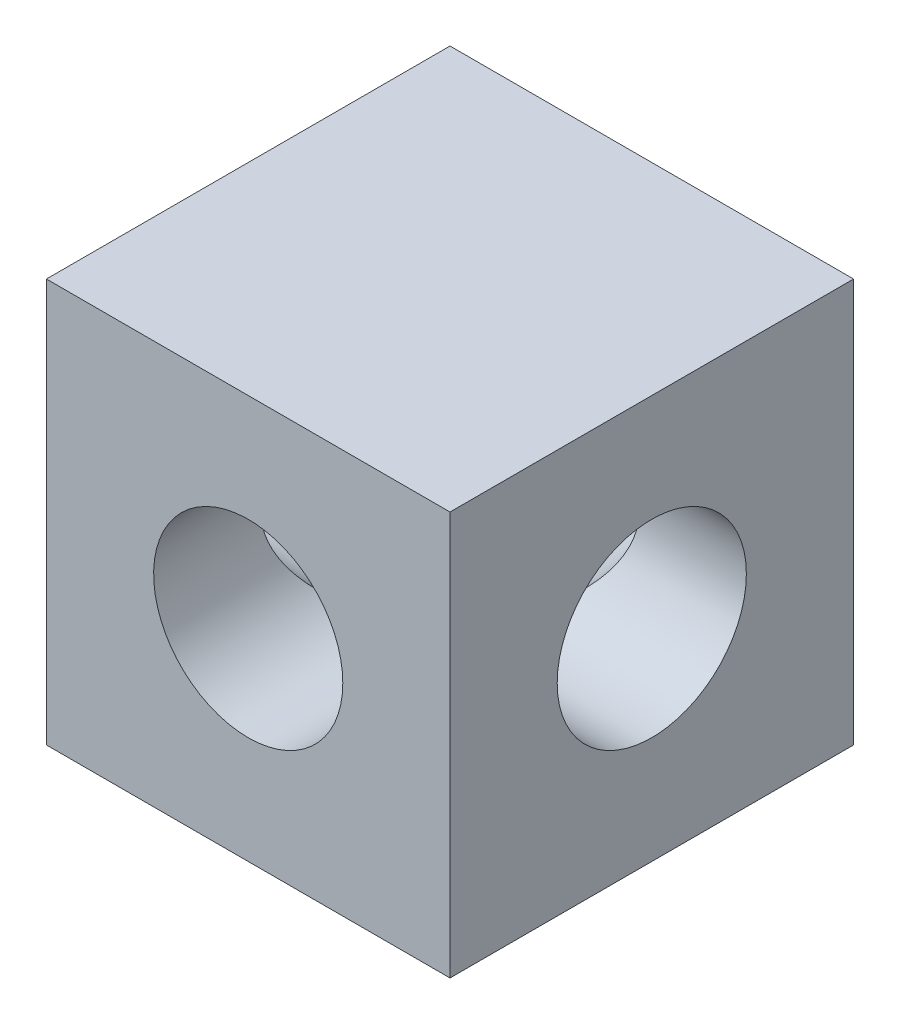
ISO-10303-21;
HEADER;
FILE_DESCRIPTION(('STEP AP214'),'2;1');
FILE_NAME('part.step','',(''),(''),'','','');
FILE_SCHEMA(('AUTOMOTIVE_DESIGN { 1 0 10303 214 1 1 1 1 }'));
ENDSEC;
DATA;
#1=APPLICATION_CONTEXT('core data for automotive mechanical design processes');
#2=APPLICATION_PROTOCOL_DEFINITION('international standard','automotive_design',2000,#1);
#3=PRODUCT_CONTEXT('',#1,'mechanical');
#4=PRODUCT('Part','Part','',(#3));
#5=PRODUCT_RELATED_PRODUCT_CATEGORY('part','',(#4));
#6=PRODUCT_DEFINITION_FORMATION('','',#4);
#7=PRODUCT_DEFINITION_CONTEXT('part definition',#1,'design');
#8=PRODUCT_DEFINITION('design','',#6,#7);
#9=PRODUCT_DEFINITION_SHAPE('','',#8);
#10=(LENGTH_UNIT() NAMED_UNIT(*) SI_UNIT(.MILLI.,.METRE.));
#11=(NAMED_UNIT(*) PLANE_ANGLE_UNIT() SI_UNIT($,.RADIAN.));
#12=(NAMED_UNIT(*) SI_UNIT($,.STERADIAN.) SOLID_ANGLE_UNIT());
#13=UNCERTAINTY_MEASURE_WITH_UNIT(LENGTH_MEASURE(1.E-05),#10,'distance_accuracy_value','');
#14=(GEOMETRIC_REPRESENTATION_CONTEXT(3) GLOBAL_UNCERTAINTY_ASSIGNED_CONTEXT((#13)) GLOBAL_UNIT_ASSIGNED_CONTEXT((#10,
#11,#12)) REPRESENTATION_CONTEXT('',''));
#15=CARTESIAN_POINT('',(0.,0.,0.));
#16=DIRECTION('',(0.,0.,1.));
#17=DIRECTION('',(1.,0.,0.));
#18=AXIS2_PLACEMENT_3D('',#15,#16,#17);
#19=CARTESIAN_POINT('',(0.,0.,10.16));
#20=DIRECTION('',(0.,0.,-1.));
#21=DIRECTION('',(-1.,0.,0.));
#22=AXIS2_PLACEMENT_3D('',#19,#20,#21);
#23=CYLINDRICAL_SURFACE('',#22,4.7625);
#24=CARTESIAN_POINT('',(0.,0.,0.));
#25=DIRECTION('',(0.707106781186547,0.,-0.707106781186547));
#26=DIRECTION('',(-0.707106781186547,0.,-0.707106781186547));
#27=AXIS2_PLACEMENT_3D('',#24,#25,#26);
#28=ELLIPSE('',#27,6.73519209080187,4.7625);
#29=CARTESIAN_POINT('',(0.,-4.7625,0.));
#30=VERTEX_POINT('',#29);
#31=CARTESIAN_POINT('',(0.,4.7625,0.));
#32=VERTEX_POINT('',#31);
#33=EDGE_CURVE('E11',#30,#32,#28,.F.);
#34=ORIENTED_EDGE('',*,*,#33,.F.);
#35=CARTESIAN_POINT('',(0.,0.,0.));
#36=DIRECTION('',(-0.707106781186547,0.,-0.707106781186547));
#37=DIRECTION('',(0.707106781186547,0.,-0.707106781186547));
#38=AXIS2_PLACEMENT_3D('',#35,#36,#37);
#39=ELLIPSE('',#38,6.73519209080187,4.7625);
#40=EDGE_CURVE('E46',#32,#30,#39,.F.);
#41=ORIENTED_EDGE('',*,*,#40,.F.);
#42=EDGE_LOOP('',(#34,#41));
#43=FACE_BOUND('',#42,.T.);
#44=CARTESIAN_POINT('',(0.,0.,10.16));
#45=DIRECTION('',(0.,0.,1.));
#46=DIRECTION('',(1.,0.,0.));
#47=AXIS2_PLACEMENT_3D('',#44,#45,#46);
#48=CIRCLE('',#47,4.7625);
#49=CARTESIAN_POINT('',(4.7625,0.,10.16));
#50=VERTEX_POINT('',#49);
#51=EDGE_CURVE('E121',#50,#50,#48,.T.);
#52=ORIENTED_EDGE('',*,*,#51,.T.);
#53=EDGE_LOOP('',(#52));
#54=FACE_BOUND('',#53,.T.);
#55=ADVANCED_FACE('F32',(#43,#54),#23,.F.);
#56=CARTESIAN_POINT('',(0.,0.,10.16));
#57=DIRECTION('',(0.,0.,-1.));
#58=DIRECTION('',(-1.,0.,0.));
#59=AXIS2_PLACEMENT_3D('',#56,#57,#58);
#60=PLANE('',#59);
#61=DIRECTION('',(0.,1.,0.));
#62=VECTOR('',#61,1.);
#63=CARTESIAN_POINT('',(10.16,-10.16,10.16));
#64=LINE('',#63,#62);
#65=CARTESIAN_POINT('',(10.16,-10.16,10.16));
#66=VERTEX_POINT('',#65);
#67=CARTESIAN_POINT('',(10.16,10.16,10.16));
#68=VERTEX_POINT('',#67);
#69=EDGE_CURVE('E113',#66,#68,#64,.T.);
#70=ORIENTED_EDGE('',*,*,#69,.T.);
#71=DIRECTION('',(-1.,0.,0.));
#72=VECTOR('',#71,1.);
#73=CARTESIAN_POINT('',(-10.16,10.16,10.16));
#74=LINE('',#73,#72);
#75=CARTESIAN_POINT('',(-10.16,10.16,10.16));
#76=VERTEX_POINT('',#75);
#77=EDGE_CURVE('E84',#68,#76,#74,.T.);
#78=ORIENTED_EDGE('',*,*,#77,.T.);
#79=DIRECTION('',(0.,-1.,0.));
#80=VECTOR('',#79,1.);
#81=CARTESIAN_POINT('',(-10.16,-10.16,10.16));
#82=LINE('',#81,#80);
#83=CARTESIAN_POINT('',(-10.16,-10.16,10.16));
#84=VERTEX_POINT('',#83);
#85=EDGE_CURVE('E123',#76,#84,#82,.T.);
#86=ORIENTED_EDGE('',*,*,#85,.T.);
#87=DIRECTION('',(1.,0.,0.));
#88=VECTOR('',#87,1.);
#89=CARTESIAN_POINT('',(-10.16,-10.16,10.16));
#90=LINE('',#89,#88);
#91=EDGE_CURVE('E55',#84,#66,#90,.T.);
#92=ORIENTED_EDGE('',*,*,#91,.T.);
#93=EDGE_LOOP('',(#70,#78,#86,#92));
#94=FACE_BOUND('',#93,.T.);
#95=ORIENTED_EDGE('',*,*,#51,.F.);
#96=EDGE_LOOP('',(#95));
#97=FACE_BOUND('',#96,.T.);
#98=ADVANCED_FACE('F150',(#94,#97),#60,.F.);
#99=CARTESIAN_POINT('',(0.,0.,-10.16));
#100=DIRECTION('',(0.,0.,-1.));
#101=DIRECTION('',(-1.,0.,0.));
#102=AXIS2_PLACEMENT_3D('',#99,#100,#101);
#103=PLANE('',#102);
#104=DIRECTION('',(0.,1.,0.));
#105=VECTOR('',#104,1.);
#106=CARTESIAN_POINT('',(10.16,-10.16,-10.16));
#107=LINE('',#106,#105);
#108=CARTESIAN_POINT('',(10.16,-10.16,-10.16));
#109=VERTEX_POINT('',#108);
#110=CARTESIAN_POINT('',(10.16,10.16,-10.16));
#111=VERTEX_POINT('',#110);
#112=EDGE_CURVE('E118',#109,#111,#107,.T.);
#113=ORIENTED_EDGE('',*,*,#112,.F.);
#114=DIRECTION('',(1.,0.,0.));
#115=VECTOR('',#114,1.);
#116=CARTESIAN_POINT('',(-10.16,-10.16,-10.16));
#117=LINE('',#116,#115);
#118=CARTESIAN_POINT('',(-10.16,-10.16,-10.16));
#119=VERTEX_POINT('',#118);
#120=EDGE_CURVE('E76',#119,#109,#117,.T.);
#121=ORIENTED_EDGE('',*,*,#120,.F.);
#122=DIRECTION('',(0.,-1.,0.));
#123=VECTOR('',#122,1.);
#124=CARTESIAN_POINT('',(-10.16,-10.16,-10.16));
#125=LINE('',#124,#123);
#126=CARTESIAN_POINT('',(-10.16,10.16,-10.16));
#127=VERTEX_POINT('',#126);
#128=EDGE_CURVE('E114',#127,#119,#125,.T.);
#129=ORIENTED_EDGE('',*,*,#128,.F.);
#130=DIRECTION('',(-1.,0.,0.));
#131=VECTOR('',#130,1.);
#132=CARTESIAN_POINT('',(-10.16,10.16,-10.16));
#133=LINE('',#132,#131);
#134=EDGE_CURVE('E116',#111,#127,#133,.T.);
#135=ORIENTED_EDGE('',*,*,#134,.F.);
#136=EDGE_LOOP('',(#113,#121,#129,#135));
#137=FACE_BOUND('',#136,.T.);
#138=CARTESIAN_POINT('',(0.,0.,-10.16));
#139=DIRECTION('',(0.,0.,1.));
#140=DIRECTION('',(1.,0.,0.));
#141=AXIS2_PLACEMENT_3D('',#138,#139,#140);
#142=CIRCLE('',#141,4.7625);
#143=CARTESIAN_POINT('',(4.7625,0.,-10.16));
#144=VERTEX_POINT('',#143);
#145=EDGE_CURVE('E127',#144,#144,#142,.T.);
#146=ORIENTED_EDGE('',*,*,#145,.T.);
#147=EDGE_LOOP('',(#146));
#148=FACE_BOUND('',#147,.T.);
#149=ADVANCED_FACE('F154',(#137,#148),#103,.T.);
#150=CARTESIAN_POINT('',(10.16,-10.16,10.16));
#151=DIRECTION('',(-1.,0.,0.));
#152=DIRECTION('',(0.,0.,1.));
#153=AXIS2_PLACEMENT_3D('',#150,#151,#152);
#154=PLANE('',#153);
#155=CARTESIAN_POINT('',(10.16,0.,0.));
#156=DIRECTION('',(1.,0.,0.));
#157=DIRECTION('',(0.,0.,-1.));
#158=AXIS2_PLACEMENT_3D('',#155,#156,#157);
#159=CIRCLE('',#158,4.7625);
#160=CARTESIAN_POINT('',(10.16,0.,-4.7625));
#161=VERTEX_POINT('',#160);
#162=EDGE_CURVE('E133',#161,#161,#159,.T.);
#163=ORIENTED_EDGE('',*,*,#162,.F.);
#164=EDGE_LOOP('',(#163));
#165=FACE_BOUND('',#164,.T.);
#166=ORIENTED_EDGE('',*,*,#112,.T.);
#167=DIRECTION('',(0.,0.,-1.));
#168=VECTOR('',#167,1.);
#169=CARTESIAN_POINT('',(10.16,10.16,10.16));
#170=LINE('',#169,#168);
#171=EDGE_CURVE('E98',#68,#111,#170,.T.);
#172=ORIENTED_EDGE('',*,*,#171,.F.);
#173=ORIENTED_EDGE('',*,*,#69,.F.);
#174=DIRECTION('',(0.,0.,-1.));
#175=VECTOR('',#174,1.);
#176=CARTESIAN_POINT('',(10.16,-10.16,10.16));
#177=LINE('',#176,#175);
#178=EDGE_CURVE('E110',#66,#109,#177,.T.);
#179=ORIENTED_EDGE('',*,*,#178,.T.);
#180=EDGE_LOOP('',(#166,#172,#173,#179));
#181=FACE_BOUND('',#180,.T.);
#182=ADVANCED_FACE('F34',(#165,#181),#154,.F.);
#183=CARTESIAN_POINT('',(-10.16,10.16,10.16));
#184=DIRECTION('',(0.,-1.,0.));
#185=DIRECTION('',(0.,0.,-1.));
#186=AXIS2_PLACEMENT_3D('',#183,#184,#185);
#187=PLANE('',#186);
#188=ORIENTED_EDGE('',*,*,#134,.T.);
#189=DIRECTION('',(0.,0.,-1.));
#190=VECTOR('',#189,1.);
#191=CARTESIAN_POINT('',(-10.16,10.16,10.16));
#192=LINE('',#191,#190);
#193=EDGE_CURVE('E105',#76,#127,#192,.T.);
#194=ORIENTED_EDGE('',*,*,#193,.F.);
#195=ORIENTED_EDGE('',*,*,#77,.F.);
#196=ORIENTED_EDGE('',*,*,#171,.T.);
#197=EDGE_LOOP('',(#188,#194,#195,#196));
#198=FACE_BOUND('',#197,.T.);
#199=ADVANCED_FACE('F163',(#198),#187,.F.);
#200=CARTESIAN_POINT('',(-10.16,-10.16,10.16));
#201=DIRECTION('',(1.,0.,0.));
#202=DIRECTION('',(0.,0.,-1.));
#203=AXIS2_PLACEMENT_3D('',#200,#201,#202);
#204=PLANE('',#203);
#205=CARTESIAN_POINT('',(-10.16,0.,0.));
#206=DIRECTION('',(1.,0.,0.));
#207=DIRECTION('',(0.,0.,-1.));
#208=AXIS2_PLACEMENT_3D('',#205,#206,#207);
#209=CIRCLE('',#208,4.7625);
#210=CARTESIAN_POINT('',(-10.16,0.,-4.7625));
#211=VERTEX_POINT('',#210);
#212=EDGE_CURVE('E130',#211,#211,#209,.T.);
#213=ORIENTED_EDGE('',*,*,#212,.T.);
#214=EDGE_LOOP('',(#213));
#215=FACE_BOUND('',#214,.T.);
#216=ORIENTED_EDGE('',*,*,#128,.T.);
#217=DIRECTION('',(0.,0.,-1.));
#218=VECTOR('',#217,1.);
#219=CARTESIAN_POINT('',(-10.16,-10.16,10.16));
#220=LINE('',#219,#218);
#221=EDGE_CURVE('E108',#84,#119,#220,.T.);
#222=ORIENTED_EDGE('',*,*,#221,.F.);
#223=ORIENTED_EDGE('',*,*,#85,.F.);
#224=ORIENTED_EDGE('',*,*,#193,.T.);
#225=EDGE_LOOP('',(#216,#222,#223,#224));
#226=FACE_BOUND('',#225,.T.);
#227=ADVANCED_FACE('F139',(#215,#226),#204,.F.);
#228=CARTESIAN_POINT('',(-10.16,-10.16,10.16));
#229=DIRECTION('',(0.,1.,0.));
#230=DIRECTION('',(0.,0.,1.));
#231=AXIS2_PLACEMENT_3D('',#228,#229,#230);
#232=PLANE('',#231);
#233=ORIENTED_EDGE('',*,*,#120,.T.);
#234=ORIENTED_EDGE('',*,*,#178,.F.);
#235=ORIENTED_EDGE('',*,*,#91,.F.);
#236=ORIENTED_EDGE('',*,*,#221,.T.);
#237=EDGE_LOOP('',(#233,#234,#235,#236));
#238=FACE_BOUND('',#237,.T.);
#239=ADVANCED_FACE('F147',(#238),#232,.F.);
#240=CARTESIAN_POINT('',(0.,0.,0.));
#241=DIRECTION('',(0.707106781186547,0.,-0.707106781186547));
#242=DIRECTION('',(-0.707106781186547,0.,-0.707106781186547));
#243=AXIS2_PLACEMENT_3D('',#240,#241,#242);
#244=ELLIPSE('',#243,6.73519209080187,4.7625);
#245=EDGE_CURVE('E40',#30,#32,#244,.T.);
#246=ORIENTED_EDGE('',*,*,#245,.F.);
#247=CARTESIAN_POINT('',(0.,0.,0.));
#248=DIRECTION('',(-0.707106781186547,0.,-0.707106781186547));
#249=DIRECTION('',(0.707106781186547,0.,-0.707106781186547));
#250=AXIS2_PLACEMENT_3D('',#247,#248,#249);
#251=ELLIPSE('',#250,6.73519209080187,4.7625);
#252=EDGE_CURVE('E89',#32,#30,#251,.T.);
#253=ORIENTED_EDGE('',*,*,#252,.F.);
#254=EDGE_LOOP('',(#246,#253));
#255=FACE_BOUND('',#254,.T.);
#256=ORIENTED_EDGE('',*,*,#145,.F.);
#257=EDGE_LOOP('',(#256));
#258=FACE_BOUND('',#257,.T.);
#259=ADVANCED_FACE('F101',(#255,#258),#23,.F.);
#260=CARTESIAN_POINT('',(-10.16,0.,0.));
#261=DIRECTION('',(1.,0.,0.));
#262=DIRECTION('',(0.,0.,-1.));
#263=AXIS2_PLACEMENT_3D('',#260,#261,#262);
#264=CYLINDRICAL_SURFACE('',#263,4.7625);
#265=ORIENTED_EDGE('',*,*,#245,.T.);
#266=ORIENTED_EDGE('',*,*,#40,.T.);
#267=EDGE_LOOP('',(#265,#266));
#268=FACE_BOUND('',#267,.T.);
#269=ORIENTED_EDGE('',*,*,#212,.F.);
#270=EDGE_LOOP('',(#269));
#271=FACE_BOUND('',#270,.T.);
#272=ADVANCED_FACE('F96',(#268,#271),#264,.F.);
#273=ORIENTED_EDGE('',*,*,#33,.T.);
#274=ORIENTED_EDGE('',*,*,#252,.T.);
#275=EDGE_LOOP('',(#273,#274));
#276=FACE_BOUND('',#275,.T.);
#277=ORIENTED_EDGE('',*,*,#162,.T.);
#278=EDGE_LOOP('',(#277));
#279=FACE_BOUND('',#278,.T.);
#280=ADVANCED_FACE('F90',(#276,#279),#264,.F.);
#281=CLOSED_SHELL('',(#55,#98,#149,#182,#199,#227,#239,#259,#272,#280));
#282=MANIFOLD_SOLID_BREP('B2',#281);
#283=ADVANCED_BREP_SHAPE_REPRESENTATION('',(#18,#282),#14);
#284=SHAPE_DEFINITION_REPRESENTATION(#9,#283);
ENDSEC;
END-ISO-10303-21;
